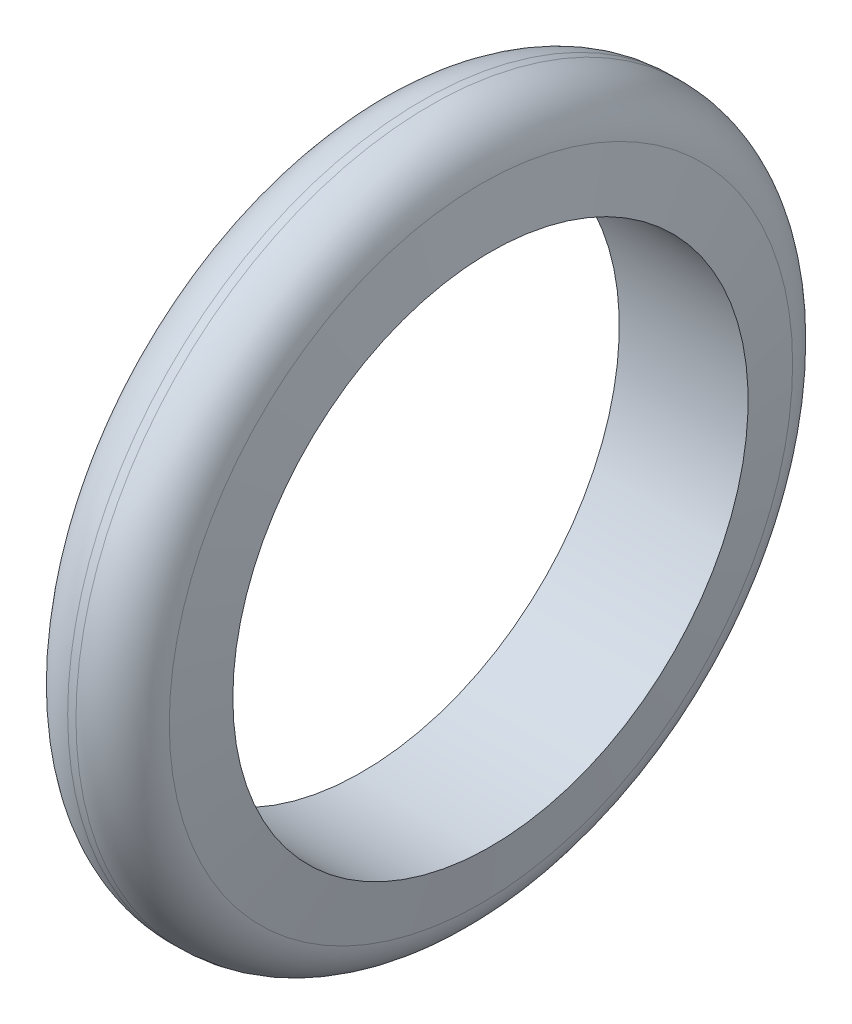
ISO-10303-21;
HEADER;
FILE_DESCRIPTION(('STEP AP214'),'2;1');
FILE_NAME('part.step','',(''),(''),'','','');
FILE_SCHEMA(('AUTOMOTIVE_DESIGN { 1 0 10303 214 1 1 1 1 }'));
ENDSEC;
DATA;
#1=APPLICATION_CONTEXT('core data for automotive mechanical design processes');
#2=APPLICATION_PROTOCOL_DEFINITION('international standard','automotive_design',2000,#1);
#3=PRODUCT_CONTEXT('',#1,'mechanical');
#4=PRODUCT('Part','Part','',(#3));
#5=PRODUCT_RELATED_PRODUCT_CATEGORY('part','',(#4));
#6=PRODUCT_DEFINITION_FORMATION('','',#4);
#7=PRODUCT_DEFINITION_CONTEXT('part definition',#1,'design');
#8=PRODUCT_DEFINITION('design','',#6,#7);
#9=PRODUCT_DEFINITION_SHAPE('','',#8);
#10=(LENGTH_UNIT() NAMED_UNIT(*) SI_UNIT(.MILLI.,.METRE.));
#11=(NAMED_UNIT(*) PLANE_ANGLE_UNIT() SI_UNIT($,.RADIAN.));
#12=(NAMED_UNIT(*) SI_UNIT($,.STERADIAN.) SOLID_ANGLE_UNIT());
#13=UNCERTAINTY_MEASURE_WITH_UNIT(LENGTH_MEASURE(1.E-05),#10,'distance_accuracy_value','');
#14=(GEOMETRIC_REPRESENTATION_CONTEXT(3) GLOBAL_UNCERTAINTY_ASSIGNED_CONTEXT((#13)) GLOBAL_UNIT_ASSIGNED_CONTEXT((#10,
#11,#12)) REPRESENTATION_CONTEXT('',''));
#15=CARTESIAN_POINT('',(0.,0.,0.));
#16=DIRECTION('',(0.,0.,1.));
#17=DIRECTION('',(1.,0.,0.));
#18=AXIS2_PLACEMENT_3D('',#15,#16,#17);
#19=CARTESIAN_POINT('',(-7.35509528937314,0.,0.));
#20=DIRECTION('',(1.,0.,0.));
#21=DIRECTION('',(0.,0.,-1.));
#22=AXIS2_PLACEMENT_3D('',#19,#20,#21);
#23=CONICAL_SURFACE('',#22,55.,1.39626340159547);
#24=CARTESIAN_POINT('',(-8.52076026405252,0.,0.));
#25=DIRECTION('',(-1.,0.,0.));
#26=DIRECTION('',(0.,0.,1.));
#27=AXIS2_PLACEMENT_3D('',#24,#25,#26);
#28=CIRCLE('',#27,48.3891854213354);
#29=CARTESIAN_POINT('',(-8.52076026405252,0.,48.3891854213354));
#30=VERTEX_POINT('',#29);
#31=EDGE_CURVE('E47',#30,#30,#28,.T.);
#32=ORIENTED_EDGE('',*,*,#31,.T.);
#33=EDGE_LOOP('',(#32));
#34=FACE_BOUND('',#33,.T.);
#35=CARTESIAN_POINT('',(-10.,0.,0.));
#36=DIRECTION('',(-1.,0.,0.));
#37=DIRECTION('',(0.,0.,1.));
#38=AXIS2_PLACEMENT_3D('',#35,#36,#37);
#39=CIRCLE('',#38,40.);
#40=CARTESIAN_POINT('',(-10.,0.,40.));
#41=VERTEX_POINT('',#40);
#42=EDGE_CURVE('E63',#41,#41,#39,.T.);
#43=ORIENTED_EDGE('',*,*,#42,.F.);
#44=EDGE_LOOP('',(#43));
#45=FACE_BOUND('',#44,.T.);
#46=ADVANCED_FACE('F39',(#34,#45),#23,.T.);
#47=CARTESIAN_POINT('',(0.,0.,0.));
#48=DIRECTION('',(-1.,0.,0.));
#49=DIRECTION('',(0.,0.,1.));
#50=AXIS2_PLACEMENT_3D('',#47,#48,#49);
#51=CYLINDRICAL_SURFACE('',#50,40.);
#52=CARTESIAN_POINT('',(10.,0.,0.));
#53=DIRECTION('',(-1.,0.,0.));
#54=DIRECTION('',(0.,0.,1.));
#55=AXIS2_PLACEMENT_3D('',#52,#53,#54);
#56=CIRCLE('',#55,40.);
#57=CARTESIAN_POINT('',(10.,0.,40.));
#58=VERTEX_POINT('',#57);
#59=EDGE_CURVE('E67',#58,#58,#56,.T.);
#60=ORIENTED_EDGE('',*,*,#59,.F.);
#61=EDGE_LOOP('',(#60));
#62=FACE_BOUND('',#61,.T.);
#63=ORIENTED_EDGE('',*,*,#42,.T.);
#64=EDGE_LOOP('',(#63));
#65=FACE_BOUND('',#64,.T.);
#66=ADVANCED_FACE('F74',(#62,#65),#51,.F.);
#67=CARTESIAN_POINT('',(10.,0.,0.));
#68=DIRECTION('',(-1.,0.,0.));
#69=DIRECTION('',(0.,0.,1.));
#70=AXIS2_PLACEMENT_3D('',#67,#68,#69);
#71=CONICAL_SURFACE('',#70,40.,1.39626340159547);
#72=CARTESIAN_POINT('',(8.52076026405252,0.,0.));
#73=DIRECTION('',(1.,0.,0.));
#74=DIRECTION('',(0.,0.,-1.));
#75=AXIS2_PLACEMENT_3D('',#72,#73,#74);
#76=CIRCLE('',#75,48.3891854213354);
#77=CARTESIAN_POINT('',(8.52076026405252,0.,-48.3891854213354));
#78=VERTEX_POINT('',#77);
#79=EDGE_CURVE('E52',#78,#78,#76,.T.);
#80=ORIENTED_EDGE('',*,*,#79,.T.);
#81=EDGE_LOOP('',(#80));
#82=FACE_BOUND('',#81,.T.);
#83=ORIENTED_EDGE('',*,*,#59,.T.);
#84=EDGE_LOOP('',(#83));
#85=FACE_BOUND('',#84,.T.);
#86=ADVANCED_FACE('F72',(#82,#85),#71,.T.);
#87=CARTESIAN_POINT('',(0.,0.,0.));
#88=DIRECTION('',(-1.,0.,0.));
#89=DIRECTION('',(0.,0.,1.));
#90=AXIS2_PLACEMENT_3D('',#87,#88,#89);
#91=CYLINDRICAL_SURFACE('',#90,55.);
#92=CARTESIAN_POINT('',(-0.642298239954847,0.,0.));
#93=DIRECTION('',(1.,0.,0.));
#94=DIRECTION('',(0.,0.,-1.));
#95=AXIS2_PLACEMENT_3D('',#92,#93,#94);
#96=CIRCLE('',#95,55.);
#97=CARTESIAN_POINT('',(-0.642298239954847,0.,-55.));
#98=VERTEX_POINT('',#97);
#99=EDGE_CURVE('E10',#98,#98,#96,.T.);
#100=ORIENTED_EDGE('',*,*,#99,.T.);
#101=EDGE_LOOP('',(#100));
#102=FACE_BOUND('',#101,.T.);
#103=CARTESIAN_POINT('',(0.642298239954847,0.,0.));
#104=DIRECTION('',(1.,0.,0.));
#105=DIRECTION('',(0.,0.,-1.));
#106=AXIS2_PLACEMENT_3D('',#103,#104,#105);
#107=CIRCLE('',#106,55.);
#108=CARTESIAN_POINT('',(0.642298239954847,0.,-55.));
#109=VERTEX_POINT('',#108);
#110=EDGE_CURVE('E57',#109,#109,#107,.F.);
#111=ORIENTED_EDGE('',*,*,#110,.T.);
#112=EDGE_LOOP('',(#111));
#113=FACE_BOUND('',#112,.T.);
#114=ADVANCED_FACE('F87',(#102,#113),#91,.T.);
#115=CARTESIAN_POINT('',(0.642298239954847,0.,0.));
#116=DIRECTION('',(1.,0.,0.));
#117=DIRECTION('',(0.,0.,-1.));
#118=AXIS2_PLACEMENT_3D('',#115,#116,#117);
#119=TOROIDAL_SURFACE('',#118,47.,8.);
#120=ORIENTED_EDGE('',*,*,#79,.F.);
#121=EDGE_LOOP('',(#120));
#122=FACE_BOUND('',#121,.T.);
#123=ORIENTED_EDGE('',*,*,#110,.F.);
#124=EDGE_LOOP('',(#123));
#125=FACE_BOUND('',#124,.T.);
#126=ADVANCED_FACE('F85',(#122,#125),#119,.T.);
#127=CARTESIAN_POINT('',(-0.642298239954847,0.,0.));
#128=DIRECTION('',(1.,0.,0.));
#129=DIRECTION('',(0.,0.,-1.));
#130=AXIS2_PLACEMENT_3D('',#127,#128,#129);
#131=TOROIDAL_SURFACE('',#130,47.,8.);
#132=ORIENTED_EDGE('',*,*,#99,.F.);
#133=EDGE_LOOP('',(#132));
#134=FACE_BOUND('',#133,.T.);
#135=ORIENTED_EDGE('',*,*,#31,.F.);
#136=EDGE_LOOP('',(#135));
#137=FACE_BOUND('',#136,.T.);
#138=ADVANCED_FACE('F41',(#134,#137),#131,.T.);
#139=CLOSED_SHELL('',(#46,#66,#86,#114,#126,#138));
#140=MANIFOLD_SOLID_BREP('B2',#139);
#141=ADVANCED_BREP_SHAPE_REPRESENTATION('',(#18,#140),#14);
#142=SHAPE_DEFINITION_REPRESENTATION(#9,#141);
ENDSEC;
END-ISO-10303-21;
